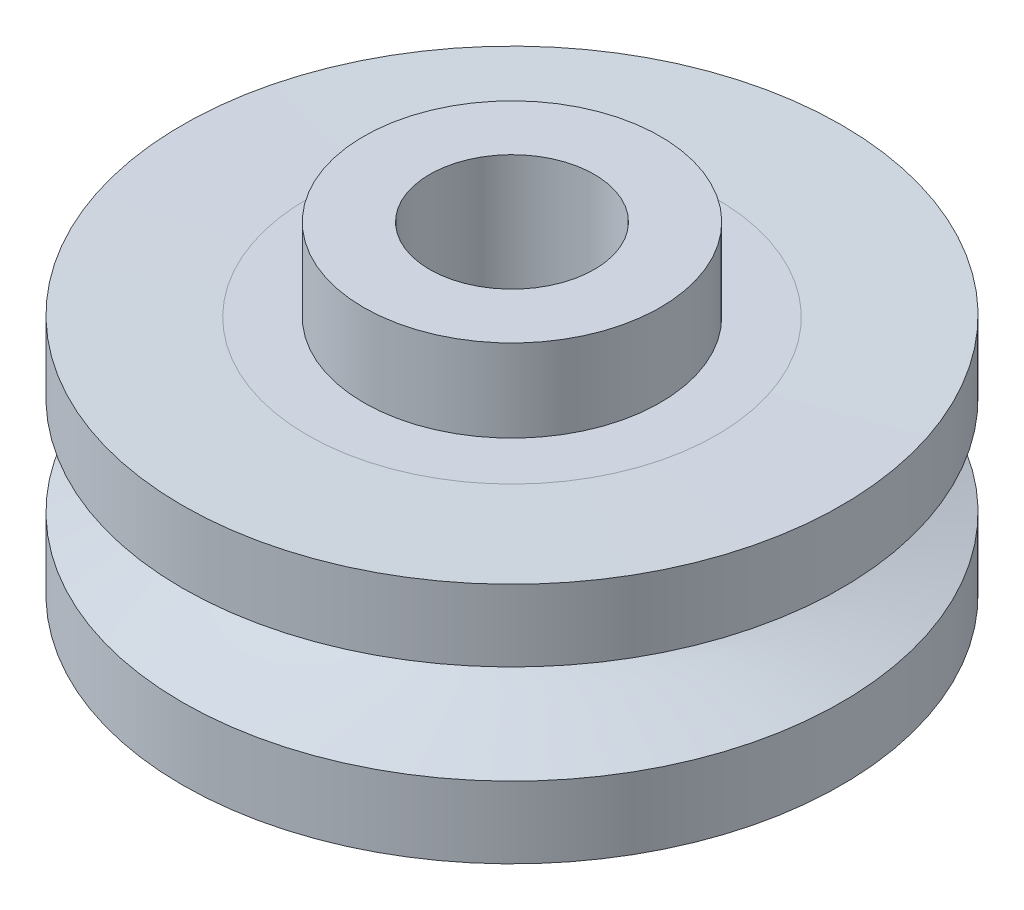
ISO-10303-21;
HEADER;
FILE_DESCRIPTION(('STEP AP214'),'2;1');
FILE_NAME('part.step','',(''),(''),'','','');
FILE_SCHEMA(('AUTOMOTIVE_DESIGN { 1 0 10303 214 1 1 1 1 }'));
ENDSEC;
DATA;
#1=APPLICATION_CONTEXT('core data for automotive mechanical design processes');
#2=APPLICATION_PROTOCOL_DEFINITION('international standard','automotive_design',2000,#1);
#3=PRODUCT_CONTEXT('',#1,'mechanical');
#4=PRODUCT('Part','Part','',(#3));
#5=PRODUCT_RELATED_PRODUCT_CATEGORY('part','',(#4));
#6=PRODUCT_DEFINITION_FORMATION('','',#4);
#7=PRODUCT_DEFINITION_CONTEXT('part definition',#1,'design');
#8=PRODUCT_DEFINITION('design','',#6,#7);
#9=PRODUCT_DEFINITION_SHAPE('','',#8);
#10=(LENGTH_UNIT() NAMED_UNIT(*) SI_UNIT(.MILLI.,.METRE.));
#11=(NAMED_UNIT(*) PLANE_ANGLE_UNIT() SI_UNIT($,.RADIAN.));
#12=(NAMED_UNIT(*) SI_UNIT($,.STERADIAN.) SOLID_ANGLE_UNIT());
#13=UNCERTAINTY_MEASURE_WITH_UNIT(LENGTH_MEASURE(1.E-05),#10,'distance_accuracy_value','');
#14=(GEOMETRIC_REPRESENTATION_CONTEXT(3) GLOBAL_UNCERTAINTY_ASSIGNED_CONTEXT((#13)) GLOBAL_UNIT_ASSIGNED_CONTEXT((#10,
#11,#12)) REPRESENTATION_CONTEXT('',''));
#15=CARTESIAN_POINT('',(0.,0.,0.));
#16=DIRECTION('',(0.,0.,1.));
#17=DIRECTION('',(1.,0.,0.));
#18=AXIS2_PLACEMENT_3D('',#15,#16,#17);
#19=CARTESIAN_POINT('',(1.,-2.45,0.));
#20=DIRECTION('',(0.,1.,0.));
#21=DIRECTION('',(0.,0.,1.));
#22=AXIS2_PLACEMENT_3D('',#19,#20,#21);
#23=PLANE('',#22);
#24=CARTESIAN_POINT('',(0.,-2.45,0.));
#25=DIRECTION('',(0.,1.,0.));
#26=DIRECTION('',(0.,0.,1.));
#27=AXIS2_PLACEMENT_3D('',#24,#25,#26);
#28=CIRCLE('',#27,1.8);
#29=CARTESIAN_POINT('',(0.,-2.45,1.8));
#30=VERTEX_POINT('',#29);
#31=EDGE_CURVE('E75',#30,#30,#28,.T.);
#32=ORIENTED_EDGE('',*,*,#31,.F.);
#33=EDGE_LOOP('',(#32));
#34=FACE_BOUND('',#33,.T.);
#35=CARTESIAN_POINT('',(0.,-2.45,0.));
#36=DIRECTION('',(0.,1.,0.));
#37=DIRECTION('',(0.,0.,1.));
#38=AXIS2_PLACEMENT_3D('',#35,#36,#37);
#39=CIRCLE('',#38,1.);
#40=CARTESIAN_POINT('',(0.,-2.45,1.));
#41=VERTEX_POINT('',#40);
#42=EDGE_CURVE('E10',#41,#41,#39,.T.);
#43=ORIENTED_EDGE('',*,*,#42,.T.);
#44=EDGE_LOOP('',(#43));
#45=FACE_BOUND('',#44,.T.);
#46=ADVANCED_FACE('F35',(#34,#45),#23,.F.);
#47=CARTESIAN_POINT('',(0.,2.07863920952884,0.));
#48=DIRECTION('',(0.,1.,0.));
#49=DIRECTION('',(0.,0.,1.));
#50=AXIS2_PLACEMENT_3D('',#47,#48,#49);
#51=CYLINDRICAL_SURFACE('',#50,1.);
#52=ORIENTED_EDGE('',*,*,#42,.F.);
#53=EDGE_LOOP('',(#52));
#54=FACE_BOUND('',#53,.T.);
#55=CARTESIAN_POINT('',(0.,2.45,0.));
#56=DIRECTION('',(0.,1.,0.));
#57=DIRECTION('',(0.,0.,1.));
#58=AXIS2_PLACEMENT_3D('',#55,#56,#57);
#59=CIRCLE('',#58,1.);
#60=CARTESIAN_POINT('',(0.,2.45,1.));
#61=VERTEX_POINT('',#60);
#62=EDGE_CURVE('E41',#61,#61,#59,.T.);
#63=ORIENTED_EDGE('',*,*,#62,.T.);
#64=EDGE_LOOP('',(#63));
#65=FACE_BOUND('',#64,.T.);
#66=ADVANCED_FACE('F110',(#54,#65),#51,.F.);
#67=CARTESIAN_POINT('',(1.,2.45,0.));
#68=DIRECTION('',(0.,-1.,0.));
#69=DIRECTION('',(0.,0.,-1.));
#70=AXIS2_PLACEMENT_3D('',#67,#68,#69);
#71=PLANE('',#70);
#72=ORIENTED_EDGE('',*,*,#62,.F.);
#73=EDGE_LOOP('',(#72));
#74=FACE_BOUND('',#73,.T.);
#75=CARTESIAN_POINT('',(0.,2.45,0.));
#76=DIRECTION('',(0.,1.,0.));
#77=DIRECTION('',(0.,0.,1.));
#78=AXIS2_PLACEMENT_3D('',#75,#76,#77);
#79=CIRCLE('',#78,1.8);
#80=CARTESIAN_POINT('',(0.,2.45,1.8));
#81=VERTEX_POINT('',#80);
#82=EDGE_CURVE('E45',#81,#81,#79,.T.);
#83=ORIENTED_EDGE('',*,*,#82,.T.);
#84=EDGE_LOOP('',(#83));
#85=FACE_BOUND('',#84,.T.);
#86=ADVANCED_FACE('F107',(#74,#85),#71,.F.);
#87=CARTESIAN_POINT('',(0.,2.07863920952884,0.));
#88=DIRECTION('',(0.,1.,0.));
#89=DIRECTION('',(0.,0.,1.));
#90=AXIS2_PLACEMENT_3D('',#87,#88,#89);
#91=CYLINDRICAL_SURFACE('',#90,1.8);
#92=ORIENTED_EDGE('',*,*,#82,.F.);
#93=EDGE_LOOP('',(#92));
#94=FACE_BOUND('',#93,.T.);
#95=CARTESIAN_POINT('',(0.,1.45,0.));
#96=DIRECTION('',(0.,1.,0.));
#97=DIRECTION('',(0.,0.,1.));
#98=AXIS2_PLACEMENT_3D('',#95,#96,#97);
#99=CIRCLE('',#98,1.8);
#100=CARTESIAN_POINT('',(0.,1.45,1.8));
#101=VERTEX_POINT('',#100);
#102=EDGE_CURVE('E49',#101,#101,#99,.T.);
#103=ORIENTED_EDGE('',*,*,#102,.T.);
#104=EDGE_LOOP('',(#103));
#105=FACE_BOUND('',#104,.T.);
#106=ADVANCED_FACE('F103',(#94,#105),#91,.T.);
#107=CARTESIAN_POINT('',(1.8,1.45,0.));
#108=DIRECTION('',(0.,-1.,0.));
#109=DIRECTION('',(0.,0.,-1.));
#110=AXIS2_PLACEMENT_3D('',#107,#108,#109);
#111=PLANE('',#110);
#112=ORIENTED_EDGE('',*,*,#102,.F.);
#113=EDGE_LOOP('',(#112));
#114=FACE_BOUND('',#113,.T.);
#115=CARTESIAN_POINT('',(0.,1.45,0.));
#116=DIRECTION('',(0.,1.,0.));
#117=DIRECTION('',(0.,0.,1.));
#118=AXIS2_PLACEMENT_3D('',#115,#116,#117);
#119=CIRCLE('',#118,2.48309671521679);
#120=CARTESIAN_POINT('',(0.,1.45,2.48309671521679));
#121=VERTEX_POINT('',#120);
#122=EDGE_CURVE('E54',#121,#121,#119,.T.);
#123=ORIENTED_EDGE('',*,*,#122,.T.);
#124=EDGE_LOOP('',(#123));
#125=FACE_BOUND('',#124,.T.);
#126=ADVANCED_FACE('F99',(#114,#125),#111,.F.);
#127=CARTESIAN_POINT('',(0.,1.46954043278815,0.));
#128=DIRECTION('',(0.,1.,0.));
#129=DIRECTION('',(0.,0.,1.));
#130=AXIS2_PLACEMENT_3D('',#127,#128,#129);
#131=CONICAL_SURFACE('',#130,4.,1.55791524713637);
#132=ORIENTED_EDGE('',*,*,#122,.F.);
#133=EDGE_LOOP('',(#132));
#134=FACE_BOUND('',#133,.T.);
#135=CARTESIAN_POINT('',(0.,1.46954043278815,0.));
#136=DIRECTION('',(0.,1.,0.));
#137=DIRECTION('',(0.,0.,1.));
#138=AXIS2_PLACEMENT_3D('',#135,#136,#137);
#139=CIRCLE('',#138,4.);
#140=CARTESIAN_POINT('',(0.,1.46954043278815,4.));
#141=VERTEX_POINT('',#140);
#142=EDGE_CURVE('E57',#141,#141,#139,.T.);
#143=ORIENTED_EDGE('',*,*,#142,.T.);
#144=EDGE_LOOP('',(#143));
#145=FACE_BOUND('',#144,.T.);
#146=ADVANCED_FACE('F95',(#134,#145),#131,.F.);
#147=CARTESIAN_POINT('',(0.,2.07863920952884,0.));
#148=DIRECTION('',(0.,1.,0.));
#149=DIRECTION('',(0.,0.,1.));
#150=AXIS2_PLACEMENT_3D('',#147,#148,#149);
#151=CYLINDRICAL_SURFACE('',#150,4.);
#152=ORIENTED_EDGE('',*,*,#142,.F.);
#153=EDGE_LOOP('',(#152));
#154=FACE_BOUND('',#153,.T.);
#155=CARTESIAN_POINT('',(0.,0.6,0.));
#156=DIRECTION('',(0.,1.,0.));
#157=DIRECTION('',(0.,0.,1.));
#158=AXIS2_PLACEMENT_3D('',#155,#156,#157);
#159=CIRCLE('',#158,4.);
#160=CARTESIAN_POINT('',(0.,0.6,4.));
#161=VERTEX_POINT('',#160);
#162=EDGE_CURVE('E60',#161,#161,#159,.T.);
#163=ORIENTED_EDGE('',*,*,#162,.T.);
#164=EDGE_LOOP('',(#163));
#165=FACE_BOUND('',#164,.T.);
#166=ADVANCED_FACE('F90',(#154,#165),#151,.T.);
#167=CARTESIAN_POINT('',(4.,-0.6,0.));
#168=CARTESIAN_POINT('',(2.33071121939687,0.,0.));
#169=CARTESIAN_POINT('',(4.,0.6,0.));
#170=(BOUNDED_CURVE() B_SPLINE_CURVE(2,(#167,#168,#169),.UNSPECIFIED.,.F.,
.F.) B_SPLINE_CURVE_WITH_KNOTS((3,3),(0.,1.),
.UNSPECIFIED.) CURVE() GEOMETRIC_REPRESENTATION_ITEM() RATIONAL_B_SPLINE_CURVE((1.,
2.56628257548659,1.)) REPRESENTATION_ITEM(''));
#171=CARTESIAN_POINT('',(0.,2.07863920952884,0.));
#172=DIRECTION('',(0.,1.,0.));
#173=AXIS1_PLACEMENT('',#171,#172);
#174=SURFACE_OF_REVOLUTION('',#170,#173);
#175=ORIENTED_EDGE('',*,*,#162,.F.);
#176=EDGE_LOOP('',(#175));
#177=FACE_BOUND('',#176,.T.);
#178=CARTESIAN_POINT('',(0.,-0.6,0.));
#179=DIRECTION('',(0.,1.,0.));
#180=DIRECTION('',(0.,0.,1.));
#181=AXIS2_PLACEMENT_3D('',#178,#179,#180);
#182=CIRCLE('',#181,4.);
#183=CARTESIAN_POINT('',(0.,-0.6,4.));
#184=VERTEX_POINT('',#183);
#185=EDGE_CURVE('E63',#184,#184,#182,.T.);
#186=ORIENTED_EDGE('',*,*,#185,.T.);
#187=EDGE_LOOP('',(#186));
#188=FACE_BOUND('',#187,.T.);
#189=ADVANCED_FACE('F85',(#177,#188),#174,.T.);
#190=CARTESIAN_POINT('',(0.,2.07863920952884,0.));
#191=DIRECTION('',(0.,1.,0.));
#192=DIRECTION('',(0.,0.,1.));
#193=AXIS2_PLACEMENT_3D('',#190,#191,#192);
#194=CYLINDRICAL_SURFACE('',#193,4.);
#195=ORIENTED_EDGE('',*,*,#185,.F.);
#196=EDGE_LOOP('',(#195));
#197=FACE_BOUND('',#196,.T.);
#198=CARTESIAN_POINT('',(0.,-1.46954043278815,0.));
#199=DIRECTION('',(0.,1.,0.));
#200=DIRECTION('',(0.,0.,1.));
#201=AXIS2_PLACEMENT_3D('',#198,#199,#200);
#202=CIRCLE('',#201,4.);
#203=CARTESIAN_POINT('',(0.,-1.46954043278815,4.));
#204=VERTEX_POINT('',#203);
#205=EDGE_CURVE('E66',#204,#204,#202,.T.);
#206=ORIENTED_EDGE('',*,*,#205,.T.);
#207=EDGE_LOOP('',(#206));
#208=FACE_BOUND('',#207,.T.);
#209=ADVANCED_FACE('F89',(#197,#208),#194,.T.);
#210=CARTESIAN_POINT('',(0.,-1.45,0.));
#211=DIRECTION('',(0.,-1.,0.));
#212=DIRECTION('',(0.,0.,-1.));
#213=AXIS2_PLACEMENT_3D('',#210,#211,#212);
#214=CONICAL_SURFACE('',#213,2.48309671521679,1.55791524713637);
#215=ORIENTED_EDGE('',*,*,#205,.F.);
#216=EDGE_LOOP('',(#215));
#217=FACE_BOUND('',#216,.T.);
#218=CARTESIAN_POINT('',(0.,-1.45,0.));
#219=DIRECTION('',(0.,1.,0.));
#220=DIRECTION('',(0.,0.,1.));
#221=AXIS2_PLACEMENT_3D('',#218,#219,#220);
#222=CIRCLE('',#221,2.48309671521679);
#223=CARTESIAN_POINT('',(0.,-1.45,2.48309671521679));
#224=VERTEX_POINT('',#223);
#225=EDGE_CURVE('E69',#224,#224,#222,.T.);
#226=ORIENTED_EDGE('',*,*,#225,.T.);
#227=EDGE_LOOP('',(#226));
#228=FACE_BOUND('',#227,.T.);
#229=ADVANCED_FACE('F130',(#217,#228),#214,.F.);
#230=CARTESIAN_POINT('',(1.8,-1.45,0.));
#231=DIRECTION('',(0.,1.,0.));
#232=DIRECTION('',(0.,0.,1.));
#233=AXIS2_PLACEMENT_3D('',#230,#231,#232);
#234=PLANE('',#233);
#235=ORIENTED_EDGE('',*,*,#225,.F.);
#236=EDGE_LOOP('',(#235));
#237=FACE_BOUND('',#236,.T.);
#238=CARTESIAN_POINT('',(0.,-1.45,0.));
#239=DIRECTION('',(0.,1.,0.));
#240=DIRECTION('',(0.,0.,1.));
#241=AXIS2_PLACEMENT_3D('',#238,#239,#240);
#242=CIRCLE('',#241,1.8);
#243=CARTESIAN_POINT('',(0.,-1.45,1.8));
#244=VERTEX_POINT('',#243);
#245=EDGE_CURVE('E72',#244,#244,#242,.T.);
#246=ORIENTED_EDGE('',*,*,#245,.T.);
#247=EDGE_LOOP('',(#246));
#248=FACE_BOUND('',#247,.T.);
#249=ADVANCED_FACE('F124',(#237,#248),#234,.F.);
#250=CARTESIAN_POINT('',(0.,2.07863920952884,0.));
#251=DIRECTION('',(0.,1.,0.));
#252=DIRECTION('',(0.,0.,1.));
#253=AXIS2_PLACEMENT_3D('',#250,#251,#252);
#254=CYLINDRICAL_SURFACE('',#253,1.8);
#255=ORIENTED_EDGE('',*,*,#245,.F.);
#256=EDGE_LOOP('',(#255));
#257=FACE_BOUND('',#256,.T.);
#258=ORIENTED_EDGE('',*,*,#31,.T.);
#259=EDGE_LOOP('',(#258));
#260=FACE_BOUND('',#259,.T.);
#261=ADVANCED_FACE('F122',(#257,#260),#254,.T.);
#262=CLOSED_SHELL('',(#46,#66,#86,#106,#126,#146,#166,#189,#209,#229,#249,#261));
#263=MANIFOLD_SOLID_BREP('B2',#262);
#264=ADVANCED_BREP_SHAPE_REPRESENTATION('',(#18,#263),#14);
#265=SHAPE_DEFINITION_REPRESENTATION(#9,#264);
ENDSEC;
END-ISO-10303-21;
